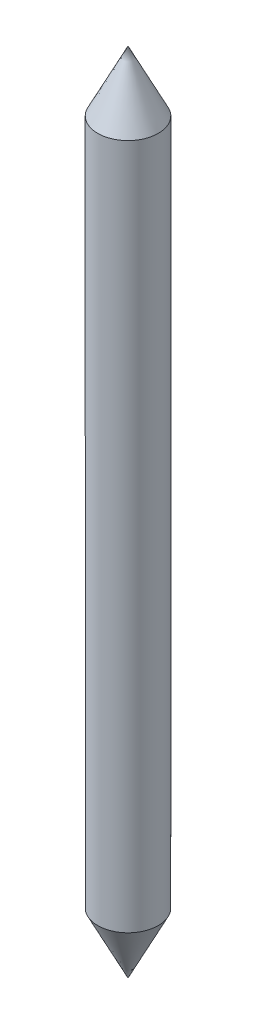
ISO-10303-21;
HEADER;
FILE_DESCRIPTION(('STEP AP214'),'2;1');
FILE_NAME('part.step','',(''),(''),'','','');
FILE_SCHEMA(('AUTOMOTIVE_DESIGN { 1 0 10303 214 1 1 1 1 }'));
ENDSEC;
DATA;
#1=APPLICATION_CONTEXT('core data for automotive mechanical design processes');
#2=APPLICATION_PROTOCOL_DEFINITION('international standard','automotive_design',2000,#1);
#3=PRODUCT_CONTEXT('',#1,'mechanical');
#4=PRODUCT('Part','Part','',(#3));
#5=PRODUCT_RELATED_PRODUCT_CATEGORY('part','',(#4));
#6=PRODUCT_DEFINITION_FORMATION('','',#4);
#7=PRODUCT_DEFINITION_CONTEXT('part definition',#1,'design');
#8=PRODUCT_DEFINITION('design','',#6,#7);
#9=PRODUCT_DEFINITION_SHAPE('','',#8);
#10=(LENGTH_UNIT() NAMED_UNIT(*) SI_UNIT(.MILLI.,.METRE.));
#11=(NAMED_UNIT(*) PLANE_ANGLE_UNIT() SI_UNIT($,.RADIAN.));
#12=(NAMED_UNIT(*) SI_UNIT($,.STERADIAN.) SOLID_ANGLE_UNIT());
#13=UNCERTAINTY_MEASURE_WITH_UNIT(LENGTH_MEASURE(1.E-05),#10,'distance_accuracy_value','');
#14=(GEOMETRIC_REPRESENTATION_CONTEXT(3) GLOBAL_UNCERTAINTY_ASSIGNED_CONTEXT((#13)) GLOBAL_UNIT_ASSIGNED_CONTEXT((#10,
#11,#12)) REPRESENTATION_CONTEXT('',''));
#15=CARTESIAN_POINT('',(0.,0.,0.));
#16=DIRECTION('',(0.,0.,1.));
#17=DIRECTION('',(1.,0.,0.));
#18=AXIS2_PLACEMENT_3D('',#15,#16,#17);
#19=CARTESIAN_POINT('',(-1.86869509208316,16.7062665180691,0.));
#20=DIRECTION('',(0.,1.,0.));
#21=DIRECTION('',(0.,0.,1.));
#22=AXIS2_PLACEMENT_3D('',#19,#20,#21);
#23=CONICAL_SURFACE('',#22,0.,0.463647609000808);
#24=CARTESIAN_POINT('',(-1.86869509208316,17.4562665180691,0.));
#25=DIRECTION('',(0.,-1.,0.));
#26=DIRECTION('',(0.,0.,-1.));
#27=AXIS2_PLACEMENT_3D('',#24,#25,#26);
#28=CIRCLE('',#27,0.375);
#29=CARTESIAN_POINT('',(-1.86869509208316,17.4562665180691,-0.375));
#30=VERTEX_POINT('',#29);
#31=EDGE_CURVE('E13',#30,#30,#28,.T.);
#32=ORIENTED_EDGE('',*,*,#31,.T.);
#33=EDGE_LOOP('',(#32));
#34=FACE_BOUND('',#33,.T.);
#35=CARTESIAN_POINT('',(-1.86869509208316,16.7062665180691,0.));
#36=VERTEX_POINT('',#35);
#37=VERTEX_LOOP('',#36);
#38=FACE_BOUND('',#37,.T.);
#39=ADVANCED_FACE('F43',(#34,#38),#23,.T.);
#40=CARTESIAN_POINT('',(-1.86869509208316,16.7062665180691,0.));
#41=DIRECTION('',(0.,-1.,0.));
#42=DIRECTION('',(0.,0.,-1.));
#43=AXIS2_PLACEMENT_3D('',#40,#41,#42);
#44=CYLINDRICAL_SURFACE('',#43,0.375);
#45=CARTESIAN_POINT('',(-1.86869509208316,25.9562665180691,0.));
#46=DIRECTION('',(0.,-1.,0.));
#47=DIRECTION('',(0.,0.,-1.));
#48=AXIS2_PLACEMENT_3D('',#45,#46,#47);
#49=CIRCLE('',#48,0.375);
#50=CARTESIAN_POINT('',(-1.86869509208316,25.9562665180691,-0.375));
#51=VERTEX_POINT('',#50);
#52=EDGE_CURVE('E50',#51,#51,#49,.T.);
#53=ORIENTED_EDGE('',*,*,#52,.T.);
#54=EDGE_LOOP('',(#53));
#55=FACE_BOUND('',#54,.T.);
#56=ORIENTED_EDGE('',*,*,#31,.F.);
#57=EDGE_LOOP('',(#56));
#58=FACE_BOUND('',#57,.T.);
#59=ADVANCED_FACE('F57',(#55,#58),#44,.T.);
#60=CARTESIAN_POINT('',(-1.86869509208316,25.9562665180691,0.));
#61=DIRECTION('',(0.,-1.,0.));
#62=DIRECTION('',(0.,0.,-1.));
#63=AXIS2_PLACEMENT_3D('',#60,#61,#62);
#64=CONICAL_SURFACE('',#63,0.375,0.463647609000806);
#65=CARTESIAN_POINT('',(-1.86869509208316,26.7062665180691,0.));
#66=VERTEX_POINT('',#65);
#67=VERTEX_LOOP('',#66);
#68=FACE_BOUND('',#67,.T.);
#69=ORIENTED_EDGE('',*,*,#52,.F.);
#70=EDGE_LOOP('',(#69));
#71=FACE_BOUND('',#70,.T.);
#72=ADVANCED_FACE('F62',(#68,#71),#64,.T.);
#73=CLOSED_SHELL('',(#39,#59,#72));
#74=MANIFOLD_SOLID_BREP('B2',#73);
#75=ADVANCED_BREP_SHAPE_REPRESENTATION('',(#18,#74),#14);
#76=SHAPE_DEFINITION_REPRESENTATION(#9,#75);
ENDSEC;
END-ISO-10303-21;
